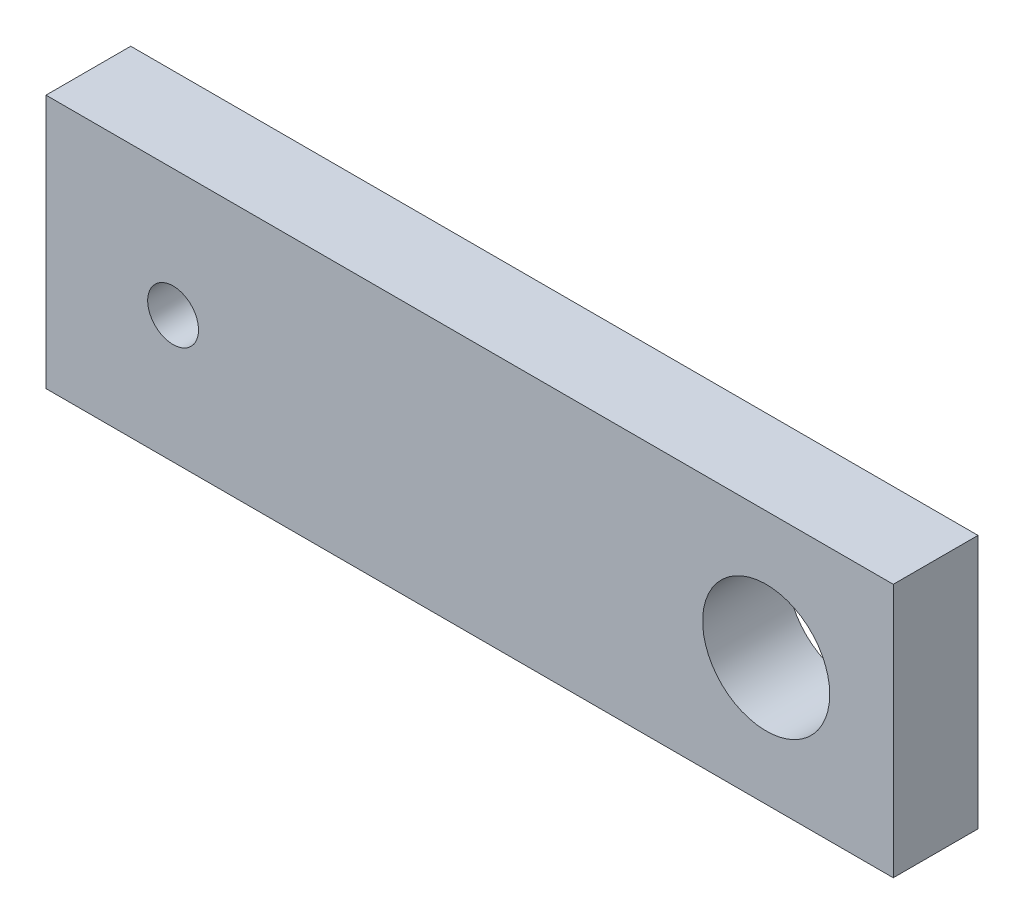
ISO-10303-21;
HEADER;
FILE_DESCRIPTION(('STEP AP214'),'2;1');
FILE_NAME('part.step','',(''),(''),'','','');
FILE_SCHEMA(('AUTOMOTIVE_DESIGN { 1 0 10303 214 1 1 1 1 }'));
ENDSEC;
DATA;
#1=APPLICATION_CONTEXT('core data for automotive mechanical design processes');
#2=APPLICATION_PROTOCOL_DEFINITION('international standard','automotive_design',2000,#1);
#3=PRODUCT_CONTEXT('',#1,'mechanical');
#4=PRODUCT('Part','Part','',(#3));
#5=PRODUCT_RELATED_PRODUCT_CATEGORY('part','',(#4));
#6=PRODUCT_DEFINITION_FORMATION('','',#4);
#7=PRODUCT_DEFINITION_CONTEXT('part definition',#1,'design');
#8=PRODUCT_DEFINITION('design','',#6,#7);
#9=PRODUCT_DEFINITION_SHAPE('','',#8);
#10=(LENGTH_UNIT() NAMED_UNIT(*) SI_UNIT(.MILLI.,.METRE.));
#11=(NAMED_UNIT(*) PLANE_ANGLE_UNIT() SI_UNIT($,.RADIAN.));
#12=(NAMED_UNIT(*) SI_UNIT($,.STERADIAN.) SOLID_ANGLE_UNIT());
#13=UNCERTAINTY_MEASURE_WITH_UNIT(LENGTH_MEASURE(1.E-05),#10,'distance_accuracy_value','');
#14=(GEOMETRIC_REPRESENTATION_CONTEXT(3) GLOBAL_UNCERTAINTY_ASSIGNED_CONTEXT((#13)) GLOBAL_UNIT_ASSIGNED_CONTEXT((#10,
#11,#12)) REPRESENTATION_CONTEXT('',''));
#15=CARTESIAN_POINT('',(0.,0.,0.));
#16=DIRECTION('',(0.,0.,1.));
#17=DIRECTION('',(1.,0.,0.));
#18=AXIS2_PLACEMENT_3D('',#15,#16,#17);
#19=CARTESIAN_POINT('',(0.,0.,2.));
#20=DIRECTION('',(0.,0.,1.));
#21=DIRECTION('',(1.,0.,0.));
#22=AXIS2_PLACEMENT_3D('',#19,#20,#21);
#23=PLANE('',#22);
#24=CARTESIAN_POINT('',(-17.,3.,2.));
#25=DIRECTION('',(0.,0.,1.));
#26=DIRECTION('',(1.,0.,0.));
#27=AXIS2_PLACEMENT_3D('',#24,#25,#26);
#28=CIRCLE('',#27,0.6);
#29=CARTESIAN_POINT('',(-16.4,3.,2.));
#30=VERTEX_POINT('',#29);
#31=EDGE_CURVE('E112',#30,#30,#28,.T.);
#32=ORIENTED_EDGE('',*,*,#31,.F.);
#33=EDGE_LOOP('',(#32));
#34=FACE_BOUND('',#33,.T.);
#35=DIRECTION('',(0.,1.,0.));
#36=VECTOR('',#35,1.);
#37=CARTESIAN_POINT('',(0.,0.,2.));
#38=LINE('',#37,#36);
#39=CARTESIAN_POINT('',(0.,0.,2.));
#40=VERTEX_POINT('',#39);
#41=CARTESIAN_POINT('',(0.,6.,2.));
#42=VERTEX_POINT('',#41);
#43=EDGE_CURVE('E92',#40,#42,#38,.T.);
#44=ORIENTED_EDGE('',*,*,#43,.T.);
#45=DIRECTION('',(-1.,0.,0.));
#46=VECTOR('',#45,1.);
#47=CARTESIAN_POINT('',(0.,6.,2.));
#48=LINE('',#47,#46);
#49=CARTESIAN_POINT('',(-20.,6.,2.));
#50=VERTEX_POINT('',#49);
#51=EDGE_CURVE('E87',#42,#50,#48,.T.);
#52=ORIENTED_EDGE('',*,*,#51,.T.);
#53=DIRECTION('',(0.,-1.,0.));
#54=VECTOR('',#53,1.);
#55=CARTESIAN_POINT('',(-20.,0.,2.));
#56=LINE('',#55,#54);
#57=CARTESIAN_POINT('',(-20.,0.,2.));
#58=VERTEX_POINT('',#57);
#59=EDGE_CURVE('E90',#50,#58,#56,.T.);
#60=ORIENTED_EDGE('',*,*,#59,.T.);
#61=DIRECTION('',(1.,0.,0.));
#62=VECTOR('',#61,1.);
#63=CARTESIAN_POINT('',(0.,0.,2.));
#64=LINE('',#63,#62);
#65=EDGE_CURVE('E57',#58,#40,#64,.T.);
#66=ORIENTED_EDGE('',*,*,#65,.T.);
#67=EDGE_LOOP('',(#44,#52,#60,#66));
#68=FACE_BOUND('',#67,.T.);
#69=CARTESIAN_POINT('',(-3.,3.,2.));
#70=DIRECTION('',(0.,0.,1.));
#71=DIRECTION('',(1.,0.,0.));
#72=AXIS2_PLACEMENT_3D('',#69,#70,#71);
#73=CIRCLE('',#72,1.5);
#74=CARTESIAN_POINT('',(-1.5,3.,2.));
#75=VERTEX_POINT('',#74);
#76=EDGE_CURVE('E134',#75,#75,#73,.T.);
#77=ORIENTED_EDGE('',*,*,#76,.F.);
#78=EDGE_LOOP('',(#77));
#79=FACE_BOUND('',#78,.T.);
#80=ADVANCED_FACE('F39',(#34,#68,#79),#23,.T.);
#81=CARTESIAN_POINT('',(0.,0.,0.));
#82=DIRECTION('',(0.,0.,1.));
#83=DIRECTION('',(1.,0.,0.));
#84=AXIS2_PLACEMENT_3D('',#81,#82,#83);
#85=PLANE('',#84);
#86=DIRECTION('',(0.,1.,0.));
#87=VECTOR('',#86,1.);
#88=CARTESIAN_POINT('',(0.,0.,0.));
#89=LINE('',#88,#87);
#90=CARTESIAN_POINT('',(0.,0.,0.));
#91=VERTEX_POINT('',#90);
#92=CARTESIAN_POINT('',(0.,6.,0.));
#93=VERTEX_POINT('',#92);
#94=EDGE_CURVE('E108',#91,#93,#89,.T.);
#95=ORIENTED_EDGE('',*,*,#94,.F.);
#96=DIRECTION('',(1.,0.,0.));
#97=VECTOR('',#96,1.);
#98=CARTESIAN_POINT('',(0.,0.,0.));
#99=LINE('',#98,#97);
#100=CARTESIAN_POINT('',(-20.,0.,0.));
#101=VERTEX_POINT('',#100);
#102=EDGE_CURVE('E80',#101,#91,#99,.T.);
#103=ORIENTED_EDGE('',*,*,#102,.F.);
#104=DIRECTION('',(0.,-1.,0.));
#105=VECTOR('',#104,1.);
#106=CARTESIAN_POINT('',(-20.,0.,0.));
#107=LINE('',#106,#105);
#108=CARTESIAN_POINT('',(-20.,6.,0.));
#109=VERTEX_POINT('',#108);
#110=EDGE_CURVE('E74',#109,#101,#107,.T.);
#111=ORIENTED_EDGE('',*,*,#110,.F.);
#112=DIRECTION('',(-1.,0.,0.));
#113=VECTOR('',#112,1.);
#114=CARTESIAN_POINT('',(0.,6.,0.));
#115=LINE('',#114,#113);
#116=EDGE_CURVE('E97',#93,#109,#115,.T.);
#117=ORIENTED_EDGE('',*,*,#116,.F.);
#118=EDGE_LOOP('',(#95,#103,#111,#117));
#119=FACE_BOUND('',#118,.T.);
#120=CARTESIAN_POINT('',(-17.,3.,0.));
#121=DIRECTION('',(0.,0.,1.));
#122=DIRECTION('',(1.,0.,0.));
#123=AXIS2_PLACEMENT_3D('',#120,#121,#122);
#124=CIRCLE('',#123,0.6);
#125=CARTESIAN_POINT('',(-16.4,3.,0.));
#126=VERTEX_POINT('',#125);
#127=EDGE_CURVE('E130',#126,#126,#124,.T.);
#128=ORIENTED_EDGE('',*,*,#127,.T.);
#129=EDGE_LOOP('',(#128));
#130=FACE_BOUND('',#129,.T.);
#131=CARTESIAN_POINT('',(-3.,3.,0.));
#132=DIRECTION('',(0.,0.,1.));
#133=DIRECTION('',(1.,0.,0.));
#134=AXIS2_PLACEMENT_3D('',#131,#132,#133);
#135=CIRCLE('',#134,1.5);
#136=CARTESIAN_POINT('',(-1.5,3.,0.));
#137=VERTEX_POINT('',#136);
#138=EDGE_CURVE('E138',#137,#137,#135,.T.);
#139=ORIENTED_EDGE('',*,*,#138,.T.);
#140=EDGE_LOOP('',(#139));
#141=FACE_BOUND('',#140,.T.);
#142=ADVANCED_FACE('F125',(#119,#130,#141),#85,.F.);
#143=CARTESIAN_POINT('',(0.,0.,2.));
#144=DIRECTION('',(-1.,0.,0.));
#145=DIRECTION('',(0.,-1.,0.));
#146=AXIS2_PLACEMENT_3D('',#143,#144,#145);
#147=PLANE('',#146);
#148=ORIENTED_EDGE('',*,*,#94,.T.);
#149=DIRECTION('',(0.,0.,-1.));
#150=VECTOR('',#149,1.);
#151=CARTESIAN_POINT('',(0.,6.,2.));
#152=LINE('',#151,#150);
#153=EDGE_CURVE('E11',#42,#93,#152,.T.);
#154=ORIENTED_EDGE('',*,*,#153,.F.);
#155=ORIENTED_EDGE('',*,*,#43,.F.);
#156=DIRECTION('',(0.,0.,-1.));
#157=VECTOR('',#156,1.);
#158=CARTESIAN_POINT('',(0.,0.,2.));
#159=LINE('',#158,#157);
#160=EDGE_CURVE('E104',#40,#91,#159,.T.);
#161=ORIENTED_EDGE('',*,*,#160,.T.);
#162=EDGE_LOOP('',(#148,#154,#155,#161));
#163=FACE_BOUND('',#162,.T.);
#164=ADVANCED_FACE('F41',(#163),#147,.F.);
#165=CARTESIAN_POINT('',(0.,6.,2.));
#166=DIRECTION('',(0.,-1.,0.));
#167=DIRECTION('',(1.,0.,0.));
#168=AXIS2_PLACEMENT_3D('',#165,#166,#167);
#169=PLANE('',#168);
#170=ORIENTED_EDGE('',*,*,#116,.T.);
#171=DIRECTION('',(0.,0.,-1.));
#172=VECTOR('',#171,1.);
#173=CARTESIAN_POINT('',(-20.,6.,2.));
#174=LINE('',#173,#172);
#175=EDGE_CURVE('E49',#50,#109,#174,.T.);
#176=ORIENTED_EDGE('',*,*,#175,.F.);
#177=ORIENTED_EDGE('',*,*,#51,.F.);
#178=ORIENTED_EDGE('',*,*,#153,.T.);
#179=EDGE_LOOP('',(#170,#176,#177,#178));
#180=FACE_BOUND('',#179,.T.);
#181=ADVANCED_FACE('F96',(#180),#169,.F.);
#182=CARTESIAN_POINT('',(-20.,0.,2.));
#183=DIRECTION('',(1.,0.,0.));
#184=DIRECTION('',(0.,0.,-1.));
#185=AXIS2_PLACEMENT_3D('',#182,#183,#184);
#186=PLANE('',#185);
#187=ORIENTED_EDGE('',*,*,#110,.T.);
#188=DIRECTION('',(0.,0.,-1.));
#189=VECTOR('',#188,1.);
#190=CARTESIAN_POINT('',(-20.,0.,2.));
#191=LINE('',#190,#189);
#192=EDGE_CURVE('E99',#58,#101,#191,.T.);
#193=ORIENTED_EDGE('',*,*,#192,.F.);
#194=ORIENTED_EDGE('',*,*,#59,.F.);
#195=ORIENTED_EDGE('',*,*,#175,.T.);
#196=EDGE_LOOP('',(#187,#193,#194,#195));
#197=FACE_BOUND('',#196,.T.);
#198=ADVANCED_FACE('F100',(#197),#186,.F.);
#199=CARTESIAN_POINT('',(0.,0.,2.));
#200=DIRECTION('',(0.,1.,0.));
#201=DIRECTION('',(-1.,0.,0.));
#202=AXIS2_PLACEMENT_3D('',#199,#200,#201);
#203=PLANE('',#202);
#204=ORIENTED_EDGE('',*,*,#102,.T.);
#205=ORIENTED_EDGE('',*,*,#160,.F.);
#206=ORIENTED_EDGE('',*,*,#65,.F.);
#207=ORIENTED_EDGE('',*,*,#192,.T.);
#208=EDGE_LOOP('',(#204,#205,#206,#207));
#209=FACE_BOUND('',#208,.T.);
#210=ADVANCED_FACE('F122',(#209),#203,.F.);
#211=CARTESIAN_POINT('',(-17.,3.,2.));
#212=DIRECTION('',(0.,0.,-1.));
#213=DIRECTION('',(-1.,0.,0.));
#214=AXIS2_PLACEMENT_3D('',#211,#212,#213);
#215=CYLINDRICAL_SURFACE('',#214,0.6);
#216=ORIENTED_EDGE('',*,*,#31,.T.);
#217=EDGE_LOOP('',(#216));
#218=FACE_BOUND('',#217,.T.);
#219=ORIENTED_EDGE('',*,*,#127,.F.);
#220=EDGE_LOOP('',(#219));
#221=FACE_BOUND('',#220,.T.);
#222=ADVANCED_FACE('F157',(#218,#221),#215,.F.);
#223=CARTESIAN_POINT('',(-3.,3.,2.));
#224=DIRECTION('',(0.,0.,-1.));
#225=DIRECTION('',(-1.,0.,0.));
#226=AXIS2_PLACEMENT_3D('',#223,#224,#225);
#227=CYLINDRICAL_SURFACE('',#226,1.5);
#228=ORIENTED_EDGE('',*,*,#76,.T.);
#229=EDGE_LOOP('',(#228));
#230=FACE_BOUND('',#229,.T.);
#231=ORIENTED_EDGE('',*,*,#138,.F.);
#232=EDGE_LOOP('',(#231));
#233=FACE_BOUND('',#232,.T.);
#234=ADVANCED_FACE('F146',(#230,#233),#227,.F.);
#235=CLOSED_SHELL('',(#80,#142,#164,#181,#198,#210,#222,#234));
#236=MANIFOLD_SOLID_BREP('B2',#235);
#237=ADVANCED_BREP_SHAPE_REPRESENTATION('',(#18,#236),#14);
#238=SHAPE_DEFINITION_REPRESENTATION(#9,#237);
ENDSEC;
END-ISO-10303-21;
